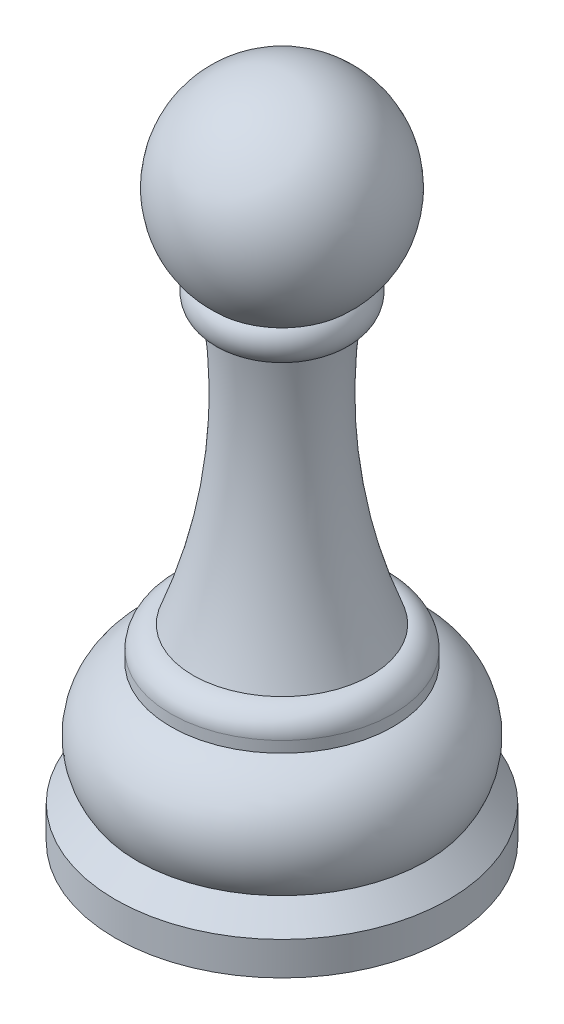
ISO-10303-21;
HEADER;
FILE_DESCRIPTION(('STEP AP214'),'2;1');
FILE_NAME('part.step','',(''),(''),'','','');
FILE_SCHEMA(('AUTOMOTIVE_DESIGN { 1 0 10303 214 1 1 1 1 }'));
ENDSEC;
DATA;
#1=APPLICATION_CONTEXT('core data for automotive mechanical design processes');
#2=APPLICATION_PROTOCOL_DEFINITION('international standard','automotive_design',2000,#1);
#3=PRODUCT_CONTEXT('',#1,'mechanical');
#4=PRODUCT('Part','Part','',(#3));
#5=PRODUCT_RELATED_PRODUCT_CATEGORY('part','',(#4));
#6=PRODUCT_DEFINITION_FORMATION('','',#4);
#7=PRODUCT_DEFINITION_CONTEXT('part definition',#1,'design');
#8=PRODUCT_DEFINITION('design','',#6,#7);
#9=PRODUCT_DEFINITION_SHAPE('','',#8);
#10=(LENGTH_UNIT() NAMED_UNIT(*) SI_UNIT(.MILLI.,.METRE.));
#11=(NAMED_UNIT(*) PLANE_ANGLE_UNIT() SI_UNIT($,.RADIAN.));
#12=(NAMED_UNIT(*) SI_UNIT($,.STERADIAN.) SOLID_ANGLE_UNIT());
#13=UNCERTAINTY_MEASURE_WITH_UNIT(LENGTH_MEASURE(1.E-05),#10,'distance_accuracy_value','');
#14=(GEOMETRIC_REPRESENTATION_CONTEXT(3) GLOBAL_UNCERTAINTY_ASSIGNED_CONTEXT((#13)) GLOBAL_UNIT_ASSIGNED_CONTEXT((#10,
#11,#12)) REPRESENTATION_CONTEXT('',''));
#15=CARTESIAN_POINT('',(0.,0.,0.));
#16=DIRECTION('',(0.,0.,1.));
#17=DIRECTION('',(1.,0.,0.));
#18=AXIS2_PLACEMENT_3D('',#15,#16,#17);
#19=CARTESIAN_POINT('',(0.,51.000000224209,0.0020089203871124));
#20=DIRECTION('',(-1.,0.,0.));
#21=DIRECTION('',(0.,0.,1.));
#22=AXIS2_PLACEMENT_3D('',#19,#20,#21);
#23=CIRCLE('',#22,9.);
#24=TRIMMED_CURVE('',#23,(PARAMETER_VALUE(-1.5710195401731)),(PARAMETER_VALUE(1.5710195401731)),
.T.,.PARAMETER.);
#25=CARTESIAN_POINT('',(0.,51.000000224209,0.));
#26=DIRECTION('',(0.,1.,0.));
#27=AXIS1_PLACEMENT('',#25,#26);
#28=SURFACE_OF_REVOLUTION('',#24,#27);
#29=CARTESIAN_POINT('',(0.,60.,0.));
#30=VERTEX_POINT('',#29);
#31=VERTEX_LOOP('',#30);
#32=FACE_BOUND('',#31,.T.);
#33=CARTESIAN_POINT('',(0.,44.29,0.));
#34=DIRECTION('',(0.,1.,0.));
#35=DIRECTION('',(0.,0.,1.));
#36=AXIS2_PLACEMENT_3D('',#33,#34,#35);
#37=CIRCLE('',#36,6.);
#38=CARTESIAN_POINT('',(0.,44.29,6.));
#39=VERTEX_POINT('',#38);
#40=EDGE_CURVE('E11',#39,#39,#37,.T.);
#41=ORIENTED_EDGE('',*,*,#40,.T.);
#42=EDGE_LOOP('',(#41));
#43=FACE_BOUND('',#42,.T.);
#44=ADVANCED_FACE('F35',(#32,#43),#28,.T.);
#45=CARTESIAN_POINT('',(0.,42.966609004825,0.));
#46=DIRECTION('',(0.,1.,0.));
#47=DIRECTION('',(0.,0.,1.));
#48=AXIS2_PLACEMENT_3D('',#45,#46,#47);
#49=TOROIDAL_SURFACE('',#48,4.50045464427058,2.);
#50=ORIENTED_EDGE('',*,*,#40,.F.);
#51=EDGE_LOOP('',(#50));
#52=FACE_BOUND('',#51,.T.);
#53=CARTESIAN_POINT('',(0.,41.03,0.));
#54=DIRECTION('',(0.,1.,0.));
#55=DIRECTION('',(0.,0.,1.));
#56=AXIS2_PLACEMENT_3D('',#53,#54,#55);
#57=CIRCLE('',#56,5.);
#58=CARTESIAN_POINT('',(0.,41.03,5.));
#59=VERTEX_POINT('',#58);
#60=EDGE_CURVE('E41',#59,#59,#57,.T.);
#61=ORIENTED_EDGE('',*,*,#60,.T.);
#62=EDGE_LOOP('',(#61));
#63=FACE_BOUND('',#62,.T.);
#64=ADVANCED_FACE('F46',(#52,#63),#49,.T.);
#65=CARTESIAN_POINT('',(0.,35.0019065796665,0.));
#66=DIRECTION('',(0.,1.,0.));
#67=DIRECTION('',(0.,0.,1.));
#68=AXIS2_PLACEMENT_3D('',#65,#66,#67);
#69=TOROIDAL_SURFACE('',#68,54.635290768925,50.);
#70=ORIENTED_EDGE('',*,*,#60,.F.);
#71=EDGE_LOOP('',(#70));
#72=FACE_BOUND('',#71,.T.);
#73=CARTESIAN_POINT('',(0.,16.97,0.));
#74=DIRECTION('',(0.,1.,0.));
#75=DIRECTION('',(0.,0.,1.));
#76=AXIS2_PLACEMENT_3D('',#73,#74,#75);
#77=CIRCLE('',#76,8.);
#78=CARTESIAN_POINT('',(0.,16.97,8.));
#79=VERTEX_POINT('',#78);
#80=EDGE_CURVE('E55',#79,#79,#77,.T.);
#81=ORIENTED_EDGE('',*,*,#80,.T.);
#82=EDGE_LOOP('',(#81));
#83=FACE_BOUND('',#82,.T.);
#84=ADVANCED_FACE('F51',(#72,#83),#69,.F.);
#85=CARTESIAN_POINT('',(0.,14.97,0.));
#86=DIRECTION('',(0.,1.,0.));
#87=DIRECTION('',(0.,0.,1.));
#88=AXIS2_PLACEMENT_3D('',#85,#86,#87);
#89=TOROIDAL_SURFACE('',#88,8.,2.);
#90=ORIENTED_EDGE('',*,*,#80,.F.);
#91=EDGE_LOOP('',(#90));
#92=FACE_BOUND('',#91,.T.);
#93=CARTESIAN_POINT('',(0.,14.97,0.));
#94=DIRECTION('',(0.,1.,0.));
#95=DIRECTION('',(0.,0.,1.));
#96=AXIS2_PLACEMENT_3D('',#93,#94,#95);
#97=CIRCLE('',#96,10.);
#98=CARTESIAN_POINT('',(0.,14.97,10.));
#99=VERTEX_POINT('',#98);
#100=EDGE_CURVE('E57',#99,#99,#97,.T.);
#101=ORIENTED_EDGE('',*,*,#100,.T.);
#102=EDGE_LOOP('',(#101));
#103=FACE_BOUND('',#102,.T.);
#104=ADVANCED_FACE('F97',(#92,#103),#89,.T.);
#105=CARTESIAN_POINT('',(0.,69.1181001809152,0.));
#106=DIRECTION('',(0.,1.,0.));
#107=DIRECTION('',(0.,0.,1.));
#108=AXIS2_PLACEMENT_3D('',#105,#106,#107);
#109=CYLINDRICAL_SURFACE('',#108,10.);
#110=ORIENTED_EDGE('',*,*,#100,.F.);
#111=EDGE_LOOP('',(#110));
#112=FACE_BOUND('',#111,.T.);
#113=CARTESIAN_POINT('',(0.,13.97,0.));
#114=DIRECTION('',(0.,1.,0.));
#115=DIRECTION('',(0.,0.,1.));
#116=AXIS2_PLACEMENT_3D('',#113,#114,#115);
#117=CIRCLE('',#116,10.);
#118=CARTESIAN_POINT('',(0.,13.97,10.));
#119=VERTEX_POINT('',#118);
#120=EDGE_CURVE('E62',#119,#119,#117,.T.);
#121=ORIENTED_EDGE('',*,*,#120,.T.);
#122=EDGE_LOOP('',(#121));
#123=FACE_BOUND('',#122,.T.);
#124=ADVANCED_FACE('F93',(#112,#123),#109,.T.);
#125=CARTESIAN_POINT('',(0.,8.31380661428568,0.));
#126=DIRECTION('',(0.,1.,0.));
#127=DIRECTION('',(0.,0.,1.));
#128=AXIS2_PLACEMENT_3D('',#125,#126,#127);
#129=TOROIDAL_SURFACE('',#128,7.99813177671417,6.);
#130=ORIENTED_EDGE('',*,*,#120,.F.);
#131=EDGE_LOOP('',(#130));
#132=FACE_BOUND('',#131,.T.);
#133=CARTESIAN_POINT('',(0.,5.,0.));
#134=DIRECTION('',(0.,1.,0.));
#135=DIRECTION('',(0.,0.,1.));
#136=AXIS2_PLACEMENT_3D('',#133,#134,#135);
#137=CIRCLE('',#136,13.);
#138=CARTESIAN_POINT('',(0.,5.,13.));
#139=VERTEX_POINT('',#138);
#140=EDGE_CURVE('E65',#139,#139,#137,.T.);
#141=ORIENTED_EDGE('',*,*,#140,.T.);
#142=EDGE_LOOP('',(#141));
#143=FACE_BOUND('',#142,.T.);
#144=ADVANCED_FACE('F89',(#132,#143),#129,.T.);
#145=CARTESIAN_POINT('',(0.,3.,0.));
#146=DIRECTION('',(0.,-1.,0.));
#147=DIRECTION('',(0.,0.,-1.));
#148=AXIS2_PLACEMENT_3D('',#145,#146,#147);
#149=CONICAL_SURFACE('',#148,15.,0.785398163397448);
#150=ORIENTED_EDGE('',*,*,#140,.F.);
#151=EDGE_LOOP('',(#150));
#152=FACE_BOUND('',#151,.T.);
#153=CARTESIAN_POINT('',(0.,3.,0.));
#154=DIRECTION('',(0.,1.,0.));
#155=DIRECTION('',(0.,0.,1.));
#156=AXIS2_PLACEMENT_3D('',#153,#154,#155);
#157=CIRCLE('',#156,15.);
#158=CARTESIAN_POINT('',(0.,3.,15.));
#159=VERTEX_POINT('',#158);
#160=EDGE_CURVE('E68',#159,#159,#157,.T.);
#161=ORIENTED_EDGE('',*,*,#160,.T.);
#162=EDGE_LOOP('',(#161));
#163=FACE_BOUND('',#162,.T.);
#164=ADVANCED_FACE('F83',(#152,#163),#149,.T.);
#165=CARTESIAN_POINT('',(0.,69.1181001809152,0.));
#166=DIRECTION('',(0.,1.,0.));
#167=DIRECTION('',(0.,0.,1.));
#168=AXIS2_PLACEMENT_3D('',#165,#166,#167);
#169=CYLINDRICAL_SURFACE('',#168,15.);
#170=ORIENTED_EDGE('',*,*,#160,.F.);
#171=EDGE_LOOP('',(#170));
#172=FACE_BOUND('',#171,.T.);
#173=CARTESIAN_POINT('',(0.,0.,0.));
#174=DIRECTION('',(0.,1.,0.));
#175=DIRECTION('',(0.,0.,1.));
#176=AXIS2_PLACEMENT_3D('',#173,#174,#175);
#177=CIRCLE('',#176,15.);
#178=CARTESIAN_POINT('',(0.,0.,15.));
#179=VERTEX_POINT('',#178);
#180=EDGE_CURVE('E71',#179,#179,#177,.T.);
#181=ORIENTED_EDGE('',*,*,#180,.T.);
#182=EDGE_LOOP('',(#181));
#183=FACE_BOUND('',#182,.T.);
#184=ADVANCED_FACE('F75',(#172,#183),#169,.T.);
#185=CARTESIAN_POINT('',(0.,0.,0.));
#186=DIRECTION('',(0.,1.,0.));
#187=DIRECTION('',(0.,0.,1.));
#188=AXIS2_PLACEMENT_3D('',#185,#186,#187);
#189=PLANE('',#188);
#190=ORIENTED_EDGE('',*,*,#180,.F.);
#191=EDGE_LOOP('',(#190));
#192=FACE_BOUND('',#191,.T.);
#193=ADVANCED_FACE('F77',(#192),#189,.F.);
#194=CLOSED_SHELL('',(#44,#64,#84,#104,#124,#144,#164,#184,#193));
#195=MANIFOLD_SOLID_BREP('B2',#194);
#196=ADVANCED_BREP_SHAPE_REPRESENTATION('',(#18,#195),#14);
#197=SHAPE_DEFINITION_REPRESENTATION(#9,#196);
ENDSEC;
END-ISO-10303-21;
